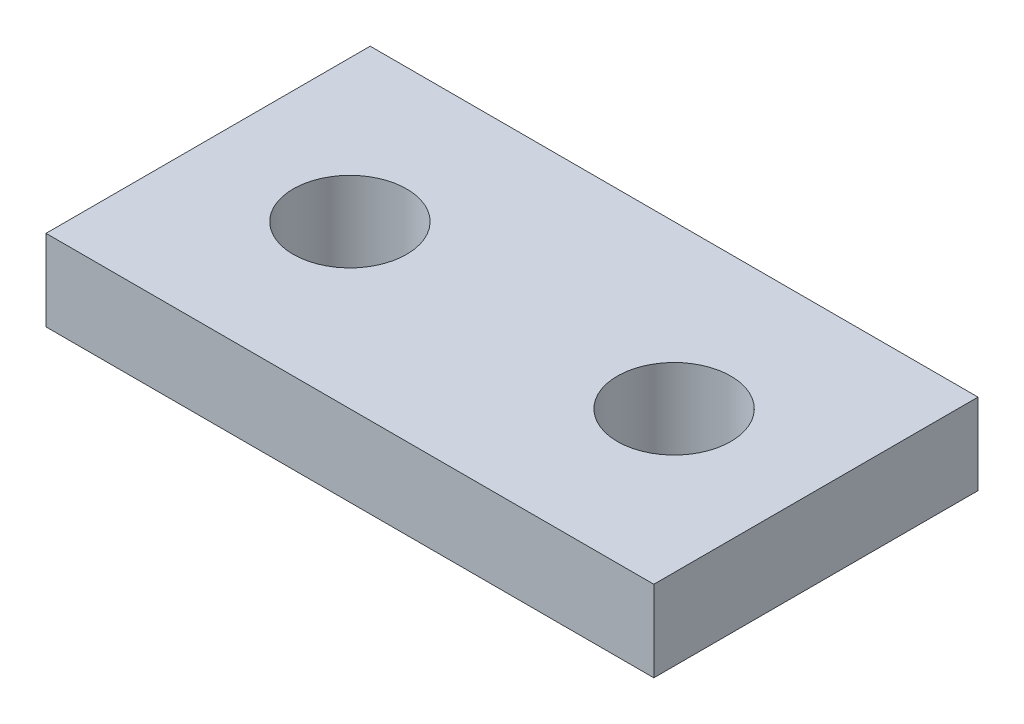
ISO-10303-21;
HEADER;
FILE_DESCRIPTION(('STEP AP214'),'2;1');
FILE_NAME('part.step','',(''),(''),'','','');
FILE_SCHEMA(('AUTOMOTIVE_DESIGN { 1 0 10303 214 1 1 1 1 }'));
ENDSEC;
DATA;
#1=APPLICATION_CONTEXT('core data for automotive mechanical design processes');
#2=APPLICATION_PROTOCOL_DEFINITION('international standard','automotive_design',2000,#1);
#3=PRODUCT_CONTEXT('',#1,'mechanical');
#4=PRODUCT('Part','Part','',(#3));
#5=PRODUCT_RELATED_PRODUCT_CATEGORY('part','',(#4));
#6=PRODUCT_DEFINITION_FORMATION('','',#4);
#7=PRODUCT_DEFINITION_CONTEXT('part definition',#1,'design');
#8=PRODUCT_DEFINITION('design','',#6,#7);
#9=PRODUCT_DEFINITION_SHAPE('','',#8);
#10=(LENGTH_UNIT() NAMED_UNIT(*) SI_UNIT(.MILLI.,.METRE.));
#11=(NAMED_UNIT(*) PLANE_ANGLE_UNIT() SI_UNIT($,.RADIAN.));
#12=(NAMED_UNIT(*) SI_UNIT($,.STERADIAN.) SOLID_ANGLE_UNIT());
#13=UNCERTAINTY_MEASURE_WITH_UNIT(LENGTH_MEASURE(1.E-05),#10,'distance_accuracy_value','');
#14=(GEOMETRIC_REPRESENTATION_CONTEXT(3) GLOBAL_UNCERTAINTY_ASSIGNED_CONTEXT((#13)) GLOBAL_UNIT_ASSIGNED_CONTEXT((#10,
#11,#12)) REPRESENTATION_CONTEXT('',''));
#15=CARTESIAN_POINT('',(0.,0.,0.));
#16=DIRECTION('',(0.,0.,1.));
#17=DIRECTION('',(1.,0.,0.));
#18=AXIS2_PLACEMENT_3D('',#15,#16,#17);
#19=CARTESIAN_POINT('',(0.,2.54,0.));
#20=DIRECTION('',(0.,-1.,0.));
#21=DIRECTION('',(0.,0.,-1.));
#22=AXIS2_PLACEMENT_3D('',#19,#20,#21);
#23=PLANE('',#22);
#24=DIRECTION('',(0.,0.,1.));
#25=VECTOR('',#24,1.);
#26=CARTESIAN_POINT('',(-9.525,2.54,0.));
#27=LINE('',#26,#25);
#28=CARTESIAN_POINT('',(-9.525,2.54,-10.16));
#29=VERTEX_POINT('',#28);
#30=CARTESIAN_POINT('',(-9.525,2.54,0.));
#31=VERTEX_POINT('',#30);
#32=EDGE_CURVE('E92',#29,#31,#27,.T.);
#33=ORIENTED_EDGE('',*,*,#32,.T.);
#34=DIRECTION('',(1.,0.,0.));
#35=VECTOR('',#34,1.);
#36=CARTESIAN_POINT('',(-9.525,2.54,0.));
#37=LINE('',#36,#35);
#38=CARTESIAN_POINT('',(9.525,2.54,0.));
#39=VERTEX_POINT('',#38);
#40=EDGE_CURVE('E87',#31,#39,#37,.T.);
#41=ORIENTED_EDGE('',*,*,#40,.T.);
#42=DIRECTION('',(0.,0.,-1.));
#43=VECTOR('',#42,1.);
#44=CARTESIAN_POINT('',(9.525,2.54,0.));
#45=LINE('',#44,#43);
#46=CARTESIAN_POINT('',(9.525,2.54,-10.16));
#47=VERTEX_POINT('',#46);
#48=EDGE_CURVE('E90',#39,#47,#45,.T.);
#49=ORIENTED_EDGE('',*,*,#48,.T.);
#50=DIRECTION('',(-1.,0.,0.));
#51=VECTOR('',#50,1.);
#52=CARTESIAN_POINT('',(-9.525,2.54,-10.16));
#53=LINE('',#52,#51);
#54=EDGE_CURVE('E57',#47,#29,#53,.T.);
#55=ORIENTED_EDGE('',*,*,#54,.T.);
#56=EDGE_LOOP('',(#33,#41,#49,#55));
#57=FACE_BOUND('',#56,.T.);
#58=CARTESIAN_POINT('',(-5.08,2.54,-5.08));
#59=DIRECTION('',(0.,1.,0.));
#60=DIRECTION('',(0.,0.,1.));
#61=AXIS2_PLACEMENT_3D('',#58,#59,#60);
#62=CIRCLE('',#61,1.778);
#63=CARTESIAN_POINT('',(-5.08,2.54,-3.302));
#64=VERTEX_POINT('',#63);
#65=EDGE_CURVE('E112',#64,#64,#62,.T.);
#66=ORIENTED_EDGE('',*,*,#65,.F.);
#67=EDGE_LOOP('',(#66));
#68=FACE_BOUND('',#67,.T.);
#69=CARTESIAN_POINT('',(5.08,2.54,-5.08));
#70=DIRECTION('',(0.,1.,0.));
#71=DIRECTION('',(0.,0.,1.));
#72=AXIS2_PLACEMENT_3D('',#69,#70,#71);
#73=CIRCLE('',#72,1.778);
#74=CARTESIAN_POINT('',(5.08,2.54,-3.302));
#75=VERTEX_POINT('',#74);
#76=EDGE_CURVE('E134',#75,#75,#73,.T.);
#77=ORIENTED_EDGE('',*,*,#76,.F.);
#78=EDGE_LOOP('',(#77));
#79=FACE_BOUND('',#78,.T.);
#80=ADVANCED_FACE('F39',(#57,#68,#79),#23,.F.);
#81=CARTESIAN_POINT('',(0.,0.,0.));
#82=DIRECTION('',(0.,-1.,0.));
#83=DIRECTION('',(0.,0.,-1.));
#84=AXIS2_PLACEMENT_3D('',#81,#82,#83);
#85=PLANE('',#84);
#86=CARTESIAN_POINT('',(-5.08,0.,-5.08));
#87=DIRECTION('',(0.,1.,0.));
#88=DIRECTION('',(0.,0.,1.));
#89=AXIS2_PLACEMENT_3D('',#86,#87,#88);
#90=CIRCLE('',#89,1.778);
#91=CARTESIAN_POINT('',(-5.08,0.,-3.302));
#92=VERTEX_POINT('',#91);
#93=EDGE_CURVE('E130',#92,#92,#90,.T.);
#94=ORIENTED_EDGE('',*,*,#93,.T.);
#95=EDGE_LOOP('',(#94));
#96=FACE_BOUND('',#95,.T.);
#97=DIRECTION('',(0.,0.,1.));
#98=VECTOR('',#97,1.);
#99=CARTESIAN_POINT('',(-9.525,0.,0.));
#100=LINE('',#99,#98);
#101=CARTESIAN_POINT('',(-9.525,0.,-10.16));
#102=VERTEX_POINT('',#101);
#103=CARTESIAN_POINT('',(-9.525,0.,0.));
#104=VERTEX_POINT('',#103);
#105=EDGE_CURVE('E108',#102,#104,#100,.T.);
#106=ORIENTED_EDGE('',*,*,#105,.F.);
#107=DIRECTION('',(-1.,0.,0.));
#108=VECTOR('',#107,1.);
#109=CARTESIAN_POINT('',(-9.525,0.,-10.16));
#110=LINE('',#109,#108);
#111=CARTESIAN_POINT('',(9.525,0.,-10.16));
#112=VERTEX_POINT('',#111);
#113=EDGE_CURVE('E80',#112,#102,#110,.T.);
#114=ORIENTED_EDGE('',*,*,#113,.F.);
#115=DIRECTION('',(0.,0.,-1.));
#116=VECTOR('',#115,1.);
#117=CARTESIAN_POINT('',(9.525,0.,0.));
#118=LINE('',#117,#116);
#119=CARTESIAN_POINT('',(9.525,0.,0.));
#120=VERTEX_POINT('',#119);
#121=EDGE_CURVE('E74',#120,#112,#118,.T.);
#122=ORIENTED_EDGE('',*,*,#121,.F.);
#123=DIRECTION('',(1.,0.,0.));
#124=VECTOR('',#123,1.);
#125=CARTESIAN_POINT('',(-9.525,0.,0.));
#126=LINE('',#125,#124);
#127=EDGE_CURVE('E97',#104,#120,#126,.T.);
#128=ORIENTED_EDGE('',*,*,#127,.F.);
#129=EDGE_LOOP('',(#106,#114,#122,#128));
#130=FACE_BOUND('',#129,.T.);
#131=CARTESIAN_POINT('',(5.08,0.,-5.08));
#132=DIRECTION('',(0.,1.,0.));
#133=DIRECTION('',(0.,0.,1.));
#134=AXIS2_PLACEMENT_3D('',#131,#132,#133);
#135=CIRCLE('',#134,1.778);
#136=CARTESIAN_POINT('',(5.08,0.,-3.302));
#137=VERTEX_POINT('',#136);
#138=EDGE_CURVE('E138',#137,#137,#135,.T.);
#139=ORIENTED_EDGE('',*,*,#138,.T.);
#140=EDGE_LOOP('',(#139));
#141=FACE_BOUND('',#140,.T.);
#142=ADVANCED_FACE('F125',(#96,#130,#141),#85,.T.);
#143=CARTESIAN_POINT('',(-9.525,2.54,0.));
#144=DIRECTION('',(1.,0.,0.));
#145=DIRECTION('',(0.,0.,-1.));
#146=AXIS2_PLACEMENT_3D('',#143,#144,#145);
#147=PLANE('',#146);
#148=ORIENTED_EDGE('',*,*,#105,.T.);
#149=DIRECTION('',(0.,-1.,0.));
#150=VECTOR('',#149,1.);
#151=CARTESIAN_POINT('',(-9.525,2.54,0.));
#152=LINE('',#151,#150);
#153=EDGE_CURVE('E11',#31,#104,#152,.T.);
#154=ORIENTED_EDGE('',*,*,#153,.F.);
#155=ORIENTED_EDGE('',*,*,#32,.F.);
#156=DIRECTION('',(0.,-1.,0.));
#157=VECTOR('',#156,1.);
#158=CARTESIAN_POINT('',(-9.525,2.54,-10.16));
#159=LINE('',#158,#157);
#160=EDGE_CURVE('E104',#29,#102,#159,.T.);
#161=ORIENTED_EDGE('',*,*,#160,.T.);
#162=EDGE_LOOP('',(#148,#154,#155,#161));
#163=FACE_BOUND('',#162,.T.);
#164=ADVANCED_FACE('F41',(#163),#147,.F.);
#165=CARTESIAN_POINT('',(-9.525,2.54,0.));
#166=DIRECTION('',(0.,0.,-1.));
#167=DIRECTION('',(-1.,0.,0.));
#168=AXIS2_PLACEMENT_3D('',#165,#166,#167);
#169=PLANE('',#168);
#170=ORIENTED_EDGE('',*,*,#127,.T.);
#171=DIRECTION('',(0.,-1.,0.));
#172=VECTOR('',#171,1.);
#173=CARTESIAN_POINT('',(9.525,2.54,0.));
#174=LINE('',#173,#172);
#175=EDGE_CURVE('E49',#39,#120,#174,.T.);
#176=ORIENTED_EDGE('',*,*,#175,.F.);
#177=ORIENTED_EDGE('',*,*,#40,.F.);
#178=ORIENTED_EDGE('',*,*,#153,.T.);
#179=EDGE_LOOP('',(#170,#176,#177,#178));
#180=FACE_BOUND('',#179,.T.);
#181=ADVANCED_FACE('F96',(#180),#169,.F.);
#182=CARTESIAN_POINT('',(9.525,2.54,0.));
#183=DIRECTION('',(-1.,0.,0.));
#184=DIRECTION('',(0.,0.,1.));
#185=AXIS2_PLACEMENT_3D('',#182,#183,#184);
#186=PLANE('',#185);
#187=ORIENTED_EDGE('',*,*,#121,.T.);
#188=DIRECTION('',(0.,-1.,0.));
#189=VECTOR('',#188,1.);
#190=CARTESIAN_POINT('',(9.525,2.54,-10.16));
#191=LINE('',#190,#189);
#192=EDGE_CURVE('E99',#47,#112,#191,.T.);
#193=ORIENTED_EDGE('',*,*,#192,.F.);
#194=ORIENTED_EDGE('',*,*,#48,.F.);
#195=ORIENTED_EDGE('',*,*,#175,.T.);
#196=EDGE_LOOP('',(#187,#193,#194,#195));
#197=FACE_BOUND('',#196,.T.);
#198=ADVANCED_FACE('F100',(#197),#186,.F.);
#199=CARTESIAN_POINT('',(-9.525,2.54,-10.16));
#200=DIRECTION('',(0.,0.,1.));
#201=DIRECTION('',(1.,0.,0.));
#202=AXIS2_PLACEMENT_3D('',#199,#200,#201);
#203=PLANE('',#202);
#204=ORIENTED_EDGE('',*,*,#113,.T.);
#205=ORIENTED_EDGE('',*,*,#160,.F.);
#206=ORIENTED_EDGE('',*,*,#54,.F.);
#207=ORIENTED_EDGE('',*,*,#192,.T.);
#208=EDGE_LOOP('',(#204,#205,#206,#207));
#209=FACE_BOUND('',#208,.T.);
#210=ADVANCED_FACE('F122',(#209),#203,.F.);
#211=CARTESIAN_POINT('',(-5.08,2.54,-5.08));
#212=DIRECTION('',(0.,-1.,0.));
#213=DIRECTION('',(0.,0.,-1.));
#214=AXIS2_PLACEMENT_3D('',#211,#212,#213);
#215=CYLINDRICAL_SURFACE('',#214,1.778);
#216=ORIENTED_EDGE('',*,*,#65,.T.);
#217=EDGE_LOOP('',(#216));
#218=FACE_BOUND('',#217,.T.);
#219=ORIENTED_EDGE('',*,*,#93,.F.);
#220=EDGE_LOOP('',(#219));
#221=FACE_BOUND('',#220,.T.);
#222=ADVANCED_FACE('F157',(#218,#221),#215,.F.);
#223=CARTESIAN_POINT('',(5.08,2.54,-5.08));
#224=DIRECTION('',(0.,-1.,0.));
#225=DIRECTION('',(0.,0.,-1.));
#226=AXIS2_PLACEMENT_3D('',#223,#224,#225);
#227=CYLINDRICAL_SURFACE('',#226,1.778);
#228=ORIENTED_EDGE('',*,*,#76,.T.);
#229=EDGE_LOOP('',(#228));
#230=FACE_BOUND('',#229,.T.);
#231=ORIENTED_EDGE('',*,*,#138,.F.);
#232=EDGE_LOOP('',(#231));
#233=FACE_BOUND('',#232,.T.);
#234=ADVANCED_FACE('F146',(#230,#233),#227,.F.);
#235=CLOSED_SHELL('',(#80,#142,#164,#181,#198,#210,#222,#234));
#236=MANIFOLD_SOLID_BREP('B2',#235);
#237=ADVANCED_BREP_SHAPE_REPRESENTATION('',(#18,#236),#14);
#238=SHAPE_DEFINITION_REPRESENTATION(#9,#237);
ENDSEC;
END-ISO-10303-21;
